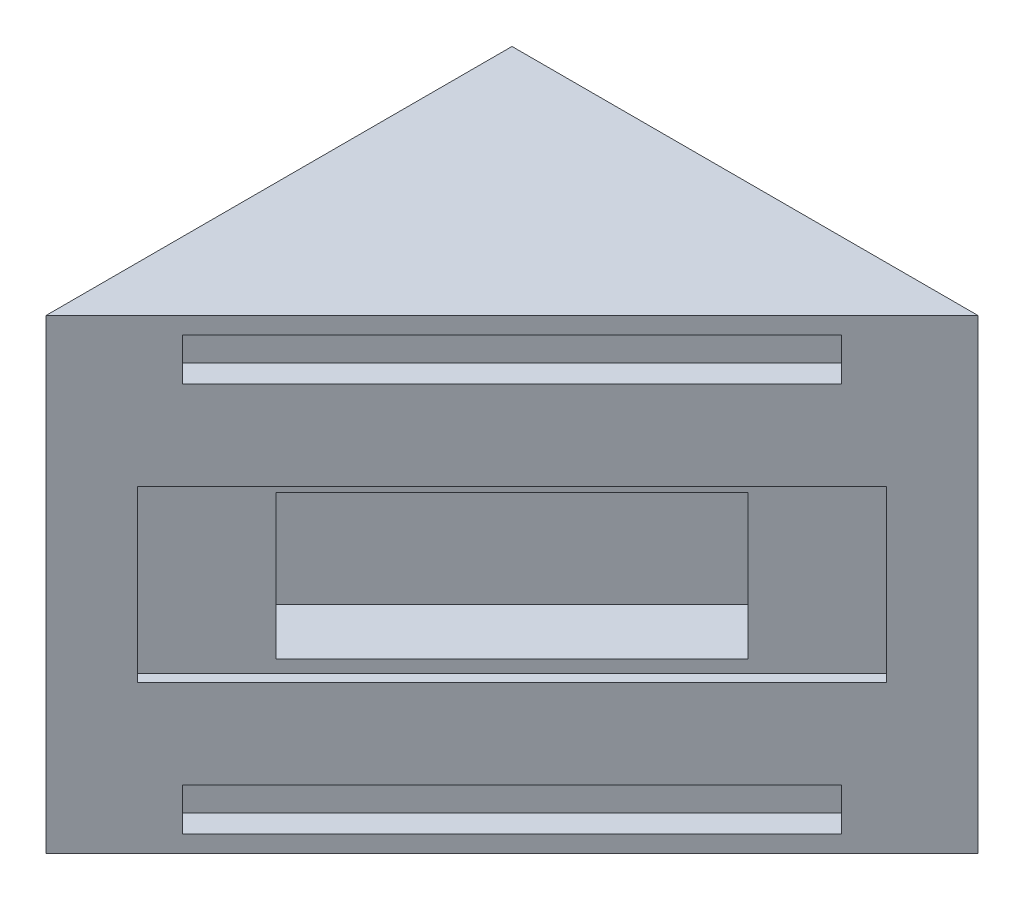
ISO-10303-21;
HEADER;
FILE_DESCRIPTION(('STEP AP214'),'2;1');
FILE_NAME('part.step','',(''),(''),'','','');
FILE_SCHEMA(('AUTOMOTIVE_DESIGN { 1 0 10303 214 1 1 1 1 }'));
ENDSEC;
DATA;
#1=APPLICATION_CONTEXT('core data for automotive mechanical design processes');
#2=APPLICATION_PROTOCOL_DEFINITION('international standard','automotive_design',2000,#1);
#3=PRODUCT_CONTEXT('',#1,'mechanical');
#4=PRODUCT('Part','Part','',(#3));
#5=PRODUCT_RELATED_PRODUCT_CATEGORY('part','',(#4));
#6=PRODUCT_DEFINITION_FORMATION('','',#4);
#7=PRODUCT_DEFINITION_CONTEXT('part definition',#1,'design');
#8=PRODUCT_DEFINITION('design','',#6,#7);
#9=PRODUCT_DEFINITION_SHAPE('','',#8);
#10=(LENGTH_UNIT() NAMED_UNIT(*) SI_UNIT(.MILLI.,.METRE.));
#11=(NAMED_UNIT(*) PLANE_ANGLE_UNIT() SI_UNIT($,.RADIAN.));
#12=(NAMED_UNIT(*) SI_UNIT($,.STERADIAN.) SOLID_ANGLE_UNIT());
#13=UNCERTAINTY_MEASURE_WITH_UNIT(LENGTH_MEASURE(1.E-05),#10,'distance_accuracy_value','');
#14=(GEOMETRIC_REPRESENTATION_CONTEXT(3) GLOBAL_UNCERTAINTY_ASSIGNED_CONTEXT((#13)) GLOBAL_UNIT_ASSIGNED_CONTEXT((#10,
#11,#12)) REPRESENTATION_CONTEXT('',''));
#15=CARTESIAN_POINT('',(0.,0.,0.));
#16=DIRECTION('',(0.,0.,1.));
#17=DIRECTION('',(1.,0.,0.));
#18=AXIS2_PLACEMENT_3D('',#15,#16,#17);
#19=CARTESIAN_POINT('',(0.,69.85,-69.85));
#20=DIRECTION('',(0.,0.,1.));
#21=DIRECTION('',(1.,0.,0.));
#22=AXIS2_PLACEMENT_3D('',#19,#20,#21);
#23=PLANE('',#22);
#24=DIRECTION('',(-1.,0.,0.));
#25=VECTOR('',#24,1.);
#26=CARTESIAN_POINT('',(0.,0.,-69.85));
#27=LINE('',#26,#25);
#28=CARTESIAN_POINT('',(69.85,0.,-69.85));
#29=VERTEX_POINT('',#28);
#30=CARTESIAN_POINT('',(0.,0.,-69.85));
#31=VERTEX_POINT('',#30);
#32=EDGE_CURVE('E67',#29,#31,#27,.T.);
#33=ORIENTED_EDGE('',*,*,#32,.T.);
#34=DIRECTION('',(0.,-1.,0.));
#35=VECTOR('',#34,1.);
#36=CARTESIAN_POINT('',(0.,69.85,-69.85));
#37=LINE('',#36,#35);
#38=CARTESIAN_POINT('',(0.,69.85,-69.85));
#39=VERTEX_POINT('',#38);
#40=EDGE_CURVE('E92',#39,#31,#37,.T.);
#41=ORIENTED_EDGE('',*,*,#40,.F.);
#42=DIRECTION('',(-1.,0.,0.));
#43=VECTOR('',#42,1.);
#44=CARTESIAN_POINT('',(0.,69.85,-69.85));
#45=LINE('',#44,#43);
#46=CARTESIAN_POINT('',(69.85,69.85,-69.85));
#47=VERTEX_POINT('',#46);
#48=EDGE_CURVE('E63',#47,#39,#45,.T.);
#49=ORIENTED_EDGE('',*,*,#48,.F.);
#50=DIRECTION('',(0.,-1.,0.));
#51=VECTOR('',#50,1.);
#52=CARTESIAN_POINT('',(69.8499999999999,69.85,-69.85));
#53=LINE('',#52,#51);
#54=EDGE_CURVE('E12',#47,#29,#53,.T.);
#55=ORIENTED_EDGE('',*,*,#54,.T.);
#56=EDGE_LOOP('',(#33,#41,#49,#55));
#57=FACE_BOUND('',#56,.T.);
#58=ADVANCED_FACE('F57',(#57),#23,.F.);
#59=CARTESIAN_POINT('',(0.,69.85,0.));
#60=DIRECTION('',(1.,0.,0.));
#61=DIRECTION('',(0.,0.,-1.));
#62=AXIS2_PLACEMENT_3D('',#59,#60,#61);
#63=PLANE('',#62);
#64=DIRECTION('',(0.,0.,1.));
#65=VECTOR('',#64,1.);
#66=CARTESIAN_POINT('',(0.,0.,0.));
#67=LINE('',#66,#65);
#68=CARTESIAN_POINT('',(0.,0.,0.));
#69=VERTEX_POINT('',#68);
#70=EDGE_CURVE('E87',#31,#69,#67,.T.);
#71=ORIENTED_EDGE('',*,*,#70,.T.);
#72=DIRECTION('',(0.,-1.,0.));
#73=VECTOR('',#72,1.);
#74=CARTESIAN_POINT('',(0.,69.85,0.));
#75=LINE('',#74,#73);
#76=CARTESIAN_POINT('',(0.,69.85,0.));
#77=VERTEX_POINT('',#76);
#78=EDGE_CURVE('E90',#77,#69,#75,.T.);
#79=ORIENTED_EDGE('',*,*,#78,.F.);
#80=DIRECTION('',(0.,0.,1.));
#81=VECTOR('',#80,1.);
#82=CARTESIAN_POINT('',(0.,69.85,0.));
#83=LINE('',#82,#81);
#84=EDGE_CURVE('E96',#39,#77,#83,.T.);
#85=ORIENTED_EDGE('',*,*,#84,.F.);
#86=ORIENTED_EDGE('',*,*,#40,.T.);
#87=EDGE_LOOP('',(#71,#79,#85,#86));
#88=FACE_BOUND('',#87,.T.);
#89=ADVANCED_FACE('F89',(#88),#63,.F.);
#90=OPEN_SHELL('',(#58,#89));
#91=SHELL_BASED_SURFACE_MODEL('B2',(#90));
#92=CARTESIAN_POINT('',(0.,69.85,0.));
#93=DIRECTION('',(0.,-1.,0.));
#94=DIRECTION('',(0.,0.,-1.));
#95=AXIS2_PLACEMENT_3D('',#92,#93,#94);
#96=PLANE('',#95);
#97=DIRECTION('',(-0.707106781186548,0.,0.707106781186547));
#98=VECTOR('',#97,1.);
#99=CARTESIAN_POINT('',(34.925,69.85,-34.9249999999999));
#100=LINE('',#99,#98);
#101=CARTESIAN_POINT('',(69.85,69.85,-69.85));
#102=VERTEX_POINT('',#101);
#103=CARTESIAN_POINT('',(0.,69.85,0.));
#104=VERTEX_POINT('',#103);
#105=EDGE_CURVE('E397',#102,#104,#100,.T.);
#106=ORIENTED_EDGE('',*,*,#105,.F.);
#107=DIRECTION('',(-1.,0.,0.));
#108=VECTOR('',#107,1.);
#109=CARTESIAN_POINT('',(0.,69.85,-69.85));
#110=LINE('',#109,#108);
#111=CARTESIAN_POINT('',(0.,69.85,-69.85));
#112=VERTEX_POINT('',#111);
#113=EDGE_CURVE('E459',#102,#112,#110,.T.);
#114=ORIENTED_EDGE('',*,*,#113,.T.);
#115=DIRECTION('',(0.,0.,1.));
#116=VECTOR('',#115,1.);
#117=CARTESIAN_POINT('',(0.,69.85,0.));
#118=LINE('',#117,#116);
#119=EDGE_CURVE('E455',#112,#104,#118,.T.);
#120=ORIENTED_EDGE('',*,*,#119,.T.);
#121=EDGE_LOOP('',(#106,#114,#120));
#122=FACE_BOUND('',#121,.T.);
#123=ADVANCED_FACE('F137',(#122),#96,.F.);
#124=CARTESIAN_POINT('',(0.,0.,0.));
#125=DIRECTION('',(0.,-1.,0.));
#126=DIRECTION('',(0.,0.,-1.));
#127=AXIS2_PLACEMENT_3D('',#124,#125,#126);
#128=PLANE('',#127);
#129=DIRECTION('',(-1.,0.,0.));
#130=VECTOR('',#129,1.);
#131=CARTESIAN_POINT('',(0.,0.,-69.85));
#132=LINE('',#131,#130);
#133=CARTESIAN_POINT('',(69.85,0.,-69.85));
#134=VERTEX_POINT('',#133);
#135=CARTESIAN_POINT('',(0.,0.,-69.85));
#136=VERTEX_POINT('',#135);
#137=EDGE_CURVE('E460',#134,#136,#132,.T.);
#138=ORIENTED_EDGE('',*,*,#137,.F.);
#139=DIRECTION('',(0.707106781186547,0.,-0.707106781186547));
#140=VECTOR('',#139,1.);
#141=CARTESIAN_POINT('',(69.85,0.,-69.85));
#142=LINE('',#141,#140);
#143=CARTESIAN_POINT('',(0.,0.,0.));
#144=VERTEX_POINT('',#143);
#145=EDGE_CURVE('E451',#144,#134,#142,.T.);
#146=ORIENTED_EDGE('',*,*,#145,.F.);
#147=DIRECTION('',(0.,0.,1.));
#148=VECTOR('',#147,1.);
#149=CARTESIAN_POINT('',(0.,0.,0.));
#150=LINE('',#149,#148);
#151=EDGE_CURVE('E454',#136,#144,#150,.T.);
#152=ORIENTED_EDGE('',*,*,#151,.F.);
#153=EDGE_LOOP('',(#138,#146,#152));
#154=FACE_BOUND('',#153,.T.);
#155=ADVANCED_FACE('F483',(#154),#128,.T.);
#156=CARTESIAN_POINT('',(0.,69.85,0.));
#157=DIRECTION('',(1.,0.,0.));
#158=DIRECTION('',(0.,0.,-1.));
#159=AXIS2_PLACEMENT_3D('',#156,#157,#158);
#160=PLANE('',#159);
#161=ORIENTED_EDGE('',*,*,#151,.T.);
#162=DIRECTION('',(0.,-1.,0.));
#163=VECTOR('',#162,1.);
#164=CARTESIAN_POINT('',(0.,69.85,0.));
#165=LINE('',#164,#163);
#166=EDGE_CURVE('E55',#104,#144,#165,.T.);
#167=ORIENTED_EDGE('',*,*,#166,.F.);
#168=ORIENTED_EDGE('',*,*,#119,.F.);
#169=DIRECTION('',(0.,-1.,0.));
#170=VECTOR('',#169,1.);
#171=CARTESIAN_POINT('',(0.,69.85,-69.85));
#172=LINE('',#171,#170);
#173=EDGE_CURVE('E463',#112,#136,#172,.T.);
#174=ORIENTED_EDGE('',*,*,#173,.T.);
#175=EDGE_LOOP('',(#161,#167,#168,#174));
#176=FACE_BOUND('',#175,.T.);
#177=ADVANCED_FACE('F139',(#176),#160,.F.);
#178=CARTESIAN_POINT('',(0.,69.85,-69.85));
#179=DIRECTION('',(0.,0.,1.));
#180=DIRECTION('',(1.,0.,0.));
#181=AXIS2_PLACEMENT_3D('',#178,#179,#180);
#182=PLANE('',#181);
#183=ORIENTED_EDGE('',*,*,#137,.T.);
#184=ORIENTED_EDGE('',*,*,#173,.F.);
#185=ORIENTED_EDGE('',*,*,#113,.F.);
#186=DIRECTION('',(0.,-1.,0.));
#187=VECTOR('',#186,1.);
#188=CARTESIAN_POINT('',(69.8499999999999,69.85,-69.85));
#189=LINE('',#188,#187);
#190=EDGE_CURVE('E146',#102,#134,#189,.T.);
#191=ORIENTED_EDGE('',*,*,#190,.T.);
#192=EDGE_LOOP('',(#183,#184,#185,#191));
#193=FACE_BOUND('',#192,.T.);
#194=ADVANCED_FACE('F476',(#193),#182,.F.);
#195=CARTESIAN_POINT('',(0.,0.,0.));
#196=DIRECTION('',(0.707106781186548,0.,0.707106781186548));
#197=DIRECTION('',(0.707106781186548,0.,-0.707106781186548));
#198=AXIS2_PLACEMENT_3D('',#195,#196,#197);
#199=PLANE('',#198);
#200=DIRECTION('',(0.,-1.,0.));
#201=VECTOR('',#200,1.);
#202=CARTESIAN_POINT('',(6.86169962165886,47.625,-6.86169962165887));
#203=LINE('',#202,#201);
#204=CARTESIAN_POINT('',(6.86169962165886,47.625,-6.86169962165887));
#205=VERTEX_POINT('',#204);
#206=CARTESIAN_POINT('',(6.86169962165887,22.225,-6.86169962165887));
#207=VERTEX_POINT('',#206);
#208=EDGE_CURVE('E161',#205,#207,#203,.T.);
#209=ORIENTED_EDGE('',*,*,#208,.F.);
#210=DIRECTION('',(-0.707106781186547,0.,0.707106781186547));
#211=VECTOR('',#210,1.);
#212=CARTESIAN_POINT('',(62.9883003783411,47.625,-62.9883003783411));
#213=LINE('',#212,#211);
#214=CARTESIAN_POINT('',(62.9883003783411,47.625,-62.9883003783411));
#215=VERTEX_POINT('',#214);
#216=EDGE_CURVE('E323',#215,#205,#213,.T.);
#217=ORIENTED_EDGE('',*,*,#216,.F.);
#218=DIRECTION('',(0.,1.,0.));
#219=VECTOR('',#218,1.);
#220=CARTESIAN_POINT('',(62.9883003783411,22.225,-62.9883003783411));
#221=LINE('',#220,#219);
#222=CARTESIAN_POINT('',(62.9883003783411,22.225,-62.9883003783411));
#223=VERTEX_POINT('',#222);
#224=EDGE_CURVE('E342',#223,#215,#221,.T.);
#225=ORIENTED_EDGE('',*,*,#224,.F.);
#226=DIRECTION('',(0.707106781186547,0.,-0.707106781186548));
#227=VECTOR('',#226,1.);
#228=CARTESIAN_POINT('',(6.86169962165886,22.225,-6.86169962165887));
#229=LINE('',#228,#227);
#230=EDGE_CURVE('E338',#207,#223,#229,.T.);
#231=ORIENTED_EDGE('',*,*,#230,.F.);
#232=EDGE_LOOP('',(#209,#217,#225,#231));
#233=FACE_BOUND('',#232,.T.);
#234=DIRECTION('',(0.,-1.,0.));
#235=VECTOR('',#234,1.);
#236=CARTESIAN_POINT('',(10.2292956670598,67.31,-10.2292956670598));
#237=LINE('',#236,#235);
#238=CARTESIAN_POINT('',(10.2292956670598,67.31,-10.2292956670598));
#239=VERTEX_POINT('',#238);
#240=CARTESIAN_POINT('',(10.2292956670598,60.96,-10.2292956670598));
#241=VERTEX_POINT('',#240);
#242=EDGE_CURVE('E379',#239,#241,#237,.T.);
#243=ORIENTED_EDGE('',*,*,#242,.F.);
#244=DIRECTION('',(-0.707106781186547,0.,0.707106781186548));
#245=VECTOR('',#244,1.);
#246=CARTESIAN_POINT('',(10.2292956670598,67.31,-10.2292956670598));
#247=LINE('',#246,#245);
#248=CARTESIAN_POINT('',(59.6207043329401,67.31,-59.6207043329402));
#249=VERTEX_POINT('',#248);
#250=EDGE_CURVE('E366',#249,#239,#247,.T.);
#251=ORIENTED_EDGE('',*,*,#250,.F.);
#252=DIRECTION('',(0.,1.,0.));
#253=VECTOR('',#252,1.);
#254=CARTESIAN_POINT('',(59.6207043329401,67.31,-59.6207043329402));
#255=LINE('',#254,#253);
#256=CARTESIAN_POINT('',(59.6207043329401,60.96,-59.6207043329401));
#257=VERTEX_POINT('',#256);
#258=EDGE_CURVE('E387',#257,#249,#255,.T.);
#259=ORIENTED_EDGE('',*,*,#258,.F.);
#260=DIRECTION('',(0.707106781186547,0.,-0.707106781186548));
#261=VECTOR('',#260,1.);
#262=CARTESIAN_POINT('',(10.2292956670598,60.96,-10.2292956670598));
#263=LINE('',#262,#261);
#264=EDGE_CURVE('E382',#241,#257,#263,.T.);
#265=ORIENTED_EDGE('',*,*,#264,.F.);
#266=EDGE_LOOP('',(#243,#251,#259,#265));
#267=FACE_BOUND('',#266,.T.);
#268=DIRECTION('',(0.,-1.,0.));
#269=VECTOR('',#268,1.);
#270=CARTESIAN_POINT('',(10.2292956670598,8.89,-10.2292956670598));
#271=LINE('',#270,#269);
#272=CARTESIAN_POINT('',(10.2292956670598,8.89,-10.2292956670598));
#273=VERTEX_POINT('',#272);
#274=CARTESIAN_POINT('',(10.2292956670598,2.54,-10.2292956670598));
#275=VERTEX_POINT('',#274);
#276=EDGE_CURVE('E383',#273,#275,#271,.T.);
#277=ORIENTED_EDGE('',*,*,#276,.F.);
#278=DIRECTION('',(-0.707106781186547,0.,0.707106781186548));
#279=VECTOR('',#278,1.);
#280=CARTESIAN_POINT('',(10.2292956670598,8.89,-10.2292956670598));
#281=LINE('',#280,#279);
#282=CARTESIAN_POINT('',(59.6207043329401,8.89,-59.6207043329402));
#283=VERTEX_POINT('',#282);
#284=EDGE_CURVE('E420',#283,#273,#281,.T.);
#285=ORIENTED_EDGE('',*,*,#284,.F.);
#286=DIRECTION('',(0.,1.,0.));
#287=VECTOR('',#286,1.);
#288=CARTESIAN_POINT('',(59.6207043329401,8.89,-59.6207043329402));
#289=LINE('',#288,#287);
#290=CARTESIAN_POINT('',(59.6207043329401,2.54,-59.6207043329402));
#291=VERTEX_POINT('',#290);
#292=EDGE_CURVE('E424',#291,#283,#289,.T.);
#293=ORIENTED_EDGE('',*,*,#292,.F.);
#294=DIRECTION('',(0.707106781186547,0.,-0.707106781186548));
#295=VECTOR('',#294,1.);
#296=CARTESIAN_POINT('',(10.2292956670598,2.54,-10.2292956670598));
#297=LINE('',#296,#295);
#298=EDGE_CURVE('E429',#275,#291,#297,.T.);
#299=ORIENTED_EDGE('',*,*,#298,.F.);
#300=EDGE_LOOP('',(#277,#285,#293,#299));
#301=FACE_BOUND('',#300,.T.);
#302=ORIENTED_EDGE('',*,*,#105,.T.);
#303=ORIENTED_EDGE('',*,*,#166,.T.);
#304=ORIENTED_EDGE('',*,*,#145,.T.);
#305=ORIENTED_EDGE('',*,*,#190,.F.);
#306=EDGE_LOOP('',(#302,#303,#304,#305));
#307=FACE_BOUND('',#306,.T.);
#308=ADVANCED_FACE('F488',(#233,#267,#301,#307),#199,.T.);
#309=CARTESIAN_POINT('',(7.53521883073905,8.89,-12.9233725033805));
#310=DIRECTION('',(-0.707106781186547,0.,0.707106781186548));
#311=DIRECTION('',(0.707106781186548,0.,0.707106781186547));
#312=AXIS2_PLACEMENT_3D('',#309,#310,#311);
#313=PLANE('',#312);
#314=ORIENTED_EDGE('',*,*,#276,.T.);
#315=DIRECTION('',(0.707106781186548,0.,0.707106781186547));
#316=VECTOR('',#315,1.);
#317=CARTESIAN_POINT('',(7.53521883073905,2.54,-12.9233725033805));
#318=LINE('',#317,#316);
#319=CARTESIAN_POINT('',(7.53521883073905,2.54,-12.9233725033805));
#320=VERTEX_POINT('',#319);
#321=EDGE_CURVE('E407',#320,#275,#318,.T.);
#322=ORIENTED_EDGE('',*,*,#321,.F.);
#323=DIRECTION('',(0.,-1.,0.));
#324=VECTOR('',#323,1.);
#325=CARTESIAN_POINT('',(7.53521883073905,8.89,-12.9233725033805));
#326=LINE('',#325,#324);
#327=CARTESIAN_POINT('',(7.53521883073905,8.89,-12.9233725033805));
#328=VERTEX_POINT('',#327);
#329=EDGE_CURVE('E425',#328,#320,#326,.T.);
#330=ORIENTED_EDGE('',*,*,#329,.F.);
#331=DIRECTION('',(0.707106781186548,0.,0.707106781186547));
#332=VECTOR('',#331,1.);
#333=CARTESIAN_POINT('',(7.53521883073905,8.89,-12.9233725033805));
#334=LINE('',#333,#332);
#335=EDGE_CURVE('E352',#328,#273,#334,.T.);
#336=ORIENTED_EDGE('',*,*,#335,.T.);
#337=EDGE_LOOP('',(#314,#322,#330,#336));
#338=FACE_BOUND('',#337,.T.);
#339=ADVANCED_FACE('F490',(#338),#313,.F.);
#340=CARTESIAN_POINT('',(7.53521883073905,8.89,-12.9233725033805));
#341=DIRECTION('',(0.,1.,0.));
#342=DIRECTION('',(0.,0.,1.));
#343=AXIS2_PLACEMENT_3D('',#340,#341,#342);
#344=PLANE('',#343);
#345=ORIENTED_EDGE('',*,*,#284,.T.);
#346=ORIENTED_EDGE('',*,*,#335,.F.);
#347=DIRECTION('',(-0.707106781186547,0.,0.707106781186548));
#348=VECTOR('',#347,1.);
#349=CARTESIAN_POINT('',(7.53521883073905,8.89,-12.9233725033805));
#350=LINE('',#349,#348);
#351=CARTESIAN_POINT('',(56.9266274966194,8.89,-62.3147811692609));
#352=VERTEX_POINT('',#351);
#353=EDGE_CURVE('E411',#352,#328,#350,.T.);
#354=ORIENTED_EDGE('',*,*,#353,.F.);
#355=DIRECTION('',(0.707106781186548,0.,0.707106781186547));
#356=VECTOR('',#355,1.);
#357=CARTESIAN_POINT('',(56.9266274966194,8.89,-62.3147811692609));
#358=LINE('',#357,#356);
#359=EDGE_CURVE('E415',#352,#283,#358,.T.);
#360=ORIENTED_EDGE('',*,*,#359,.T.);
#361=EDGE_LOOP('',(#345,#346,#354,#360));
#362=FACE_BOUND('',#361,.T.);
#363=ADVANCED_FACE('F497',(#362),#344,.F.);
#364=CARTESIAN_POINT('',(56.9266274966194,8.89,-62.3147811692609));
#365=DIRECTION('',(0.707106781186547,0.,-0.707106781186548));
#366=DIRECTION('',(-0.707106781186548,0.,-0.707106781186547));
#367=AXIS2_PLACEMENT_3D('',#364,#365,#366);
#368=PLANE('',#367);
#369=ORIENTED_EDGE('',*,*,#292,.T.);
#370=ORIENTED_EDGE('',*,*,#359,.F.);
#371=DIRECTION('',(0.,1.,0.));
#372=VECTOR('',#371,1.);
#373=CARTESIAN_POINT('',(56.9266274966194,8.89,-62.3147811692609));
#374=LINE('',#373,#372);
#375=CARTESIAN_POINT('',(56.9266274966194,2.54,-62.3147811692609));
#376=VERTEX_POINT('',#375);
#377=EDGE_CURVE('E438',#376,#352,#374,.T.);
#378=ORIENTED_EDGE('',*,*,#377,.F.);
#379=DIRECTION('',(0.707106781186548,0.,0.707106781186547));
#380=VECTOR('',#379,1.);
#381=CARTESIAN_POINT('',(56.9266274966194,2.54,-62.3147811692609));
#382=LINE('',#381,#380);
#383=EDGE_CURVE('E412',#376,#291,#382,.T.);
#384=ORIENTED_EDGE('',*,*,#383,.T.);
#385=EDGE_LOOP('',(#369,#370,#378,#384));
#386=FACE_BOUND('',#385,.T.);
#387=ADVANCED_FACE('F536',(#386),#368,.F.);
#388=CARTESIAN_POINT('',(7.53521883073905,2.54,-12.9233725033805));
#389=DIRECTION('',(0.,-1.,0.));
#390=DIRECTION('',(0.,0.,-1.));
#391=AXIS2_PLACEMENT_3D('',#388,#389,#390);
#392=PLANE('',#391);
#393=ORIENTED_EDGE('',*,*,#298,.T.);
#394=ORIENTED_EDGE('',*,*,#383,.F.);
#395=DIRECTION('',(0.707106781186547,0.,-0.707106781186548));
#396=VECTOR('',#395,1.);
#397=CARTESIAN_POINT('',(7.53521883073905,2.54,-12.9233725033805));
#398=LINE('',#397,#396);
#399=EDGE_CURVE('E442',#320,#376,#398,.T.);
#400=ORIENTED_EDGE('',*,*,#399,.F.);
#401=ORIENTED_EDGE('',*,*,#321,.T.);
#402=EDGE_LOOP('',(#393,#394,#400,#401));
#403=FACE_BOUND('',#402,.T.);
#404=ADVANCED_FACE('F547',(#403),#392,.F.);
#405=CARTESIAN_POINT('',(-2.69407683632075,0.,-2.69407683632075));
#406=DIRECTION('',(0.707106781186548,0.,0.707106781186547));
#407=DIRECTION('',(0.707106781186547,0.,-0.707106781186548));
#408=AXIS2_PLACEMENT_3D('',#405,#406,#407);
#409=PLANE('',#408);
#410=ORIENTED_EDGE('',*,*,#329,.T.);
#411=ORIENTED_EDGE('',*,*,#399,.T.);
#412=ORIENTED_EDGE('',*,*,#377,.T.);
#413=ORIENTED_EDGE('',*,*,#353,.T.);
#414=EDGE_LOOP('',(#410,#411,#412,#413));
#415=FACE_BOUND('',#414,.T.);
#416=ADVANCED_FACE('F558',(#415),#409,.T.);
#417=CARTESIAN_POINT('',(7.53521883073905,67.31,-12.9233725033805));
#418=DIRECTION('',(-0.707106781186547,0.,0.707106781186548));
#419=DIRECTION('',(0.707106781186548,0.,0.707106781186547));
#420=AXIS2_PLACEMENT_3D('',#417,#418,#419);
#421=PLANE('',#420);
#422=ORIENTED_EDGE('',*,*,#242,.T.);
#423=DIRECTION('',(0.707106781186548,0.,0.707106781186547));
#424=VECTOR('',#423,1.);
#425=CARTESIAN_POINT('',(7.53521883073905,60.96,-12.9233725033805));
#426=LINE('',#425,#424);
#427=CARTESIAN_POINT('',(7.53521883073905,60.96,-12.9233725033805));
#428=VERTEX_POINT('',#427);
#429=EDGE_CURVE('E378',#428,#241,#426,.T.);
#430=ORIENTED_EDGE('',*,*,#429,.F.);
#431=DIRECTION('',(0.,-1.,0.));
#432=VECTOR('',#431,1.);
#433=CARTESIAN_POINT('',(7.53521883073905,67.31,-12.9233725033805));
#434=LINE('',#433,#432);
#435=CARTESIAN_POINT('',(7.53521883073905,67.31,-12.9233725033805));
#436=VERTEX_POINT('',#435);
#437=EDGE_CURVE('E361',#436,#428,#434,.T.);
#438=ORIENTED_EDGE('',*,*,#437,.F.);
#439=DIRECTION('',(0.707106781186548,0.,0.707106781186547));
#440=VECTOR('',#439,1.);
#441=CARTESIAN_POINT('',(7.53521883073905,67.31,-12.9233725033805));
#442=LINE('',#441,#440);
#443=EDGE_CURVE('E394',#436,#239,#442,.T.);
#444=ORIENTED_EDGE('',*,*,#443,.T.);
#445=EDGE_LOOP('',(#422,#430,#438,#444));
#446=FACE_BOUND('',#445,.T.);
#447=ADVANCED_FACE('F569',(#446),#421,.F.);
#448=CARTESIAN_POINT('',(7.53521883073905,67.31,-12.9233725033805));
#449=DIRECTION('',(0.,1.,0.));
#450=DIRECTION('',(0.,0.,1.));
#451=AXIS2_PLACEMENT_3D('',#448,#449,#450);
#452=PLANE('',#451);
#453=ORIENTED_EDGE('',*,*,#250,.T.);
#454=ORIENTED_EDGE('',*,*,#443,.F.);
#455=DIRECTION('',(-0.707106781186547,0.,0.707106781186548));
#456=VECTOR('',#455,1.);
#457=CARTESIAN_POINT('',(7.53521883073905,67.31,-12.9233725033805));
#458=LINE('',#457,#456);
#459=CARTESIAN_POINT('',(56.9266274966194,67.31,-62.3147811692609));
#460=VERTEX_POINT('',#459);
#461=EDGE_CURVE('E374',#460,#436,#458,.T.);
#462=ORIENTED_EDGE('',*,*,#461,.F.);
#463=DIRECTION('',(0.707106781186548,0.,0.707106781186547));
#464=VECTOR('',#463,1.);
#465=CARTESIAN_POINT('',(56.9266274966194,67.31,-62.3147811692609));
#466=LINE('',#465,#464);
#467=EDGE_CURVE('E398',#460,#249,#466,.T.);
#468=ORIENTED_EDGE('',*,*,#467,.T.);
#469=EDGE_LOOP('',(#453,#454,#462,#468));
#470=FACE_BOUND('',#469,.T.);
#471=ADVANCED_FACE('F579',(#470),#452,.F.);
#472=CARTESIAN_POINT('',(56.9266274966194,67.31,-62.3147811692609));
#473=DIRECTION('',(0.707106781186547,0.,-0.707106781186548));
#474=DIRECTION('',(-0.707106781186548,0.,-0.707106781186547));
#475=AXIS2_PLACEMENT_3D('',#472,#473,#474);
#476=PLANE('',#475);
#477=ORIENTED_EDGE('',*,*,#258,.T.);
#478=ORIENTED_EDGE('',*,*,#467,.F.);
#479=DIRECTION('',(0.,1.,0.));
#480=VECTOR('',#479,1.);
#481=CARTESIAN_POINT('',(56.9266274966194,67.31,-62.3147811692609));
#482=LINE('',#481,#480);
#483=CARTESIAN_POINT('',(56.9266274966194,60.96,-62.3147811692609));
#484=VERTEX_POINT('',#483);
#485=EDGE_CURVE('E370',#484,#460,#482,.T.);
#486=ORIENTED_EDGE('',*,*,#485,.F.);
#487=DIRECTION('',(0.707106781186548,0.,0.707106781186547));
#488=VECTOR('',#487,1.);
#489=CARTESIAN_POINT('',(56.9266274966194,60.96,-62.3147811692609));
#490=LINE('',#489,#488);
#491=EDGE_CURVE('E401',#484,#257,#490,.T.);
#492=ORIENTED_EDGE('',*,*,#491,.T.);
#493=EDGE_LOOP('',(#477,#478,#486,#492));
#494=FACE_BOUND('',#493,.T.);
#495=ADVANCED_FACE('F590',(#494),#476,.F.);
#496=CARTESIAN_POINT('',(7.53521883073905,60.96,-12.9233725033805));
#497=DIRECTION('',(0.,-1.,0.));
#498=DIRECTION('',(0.,0.,-1.));
#499=AXIS2_PLACEMENT_3D('',#496,#497,#498);
#500=PLANE('',#499);
#501=ORIENTED_EDGE('',*,*,#264,.T.);
#502=ORIENTED_EDGE('',*,*,#491,.F.);
#503=DIRECTION('',(0.707106781186547,0.,-0.707106781186548));
#504=VECTOR('',#503,1.);
#505=CARTESIAN_POINT('',(7.53521883073905,60.96,-12.9233725033805));
#506=LINE('',#505,#504);
#507=EDGE_CURVE('E365',#428,#484,#506,.T.);
#508=ORIENTED_EDGE('',*,*,#507,.F.);
#509=ORIENTED_EDGE('',*,*,#429,.T.);
#510=EDGE_LOOP('',(#501,#502,#508,#509));
#511=FACE_BOUND('',#510,.T.);
#512=ADVANCED_FACE('F601',(#511),#500,.F.);
#513=CARTESIAN_POINT('',(-2.69407683632075,0.,-2.69407683632075));
#514=DIRECTION('',(0.707106781186548,0.,0.707106781186547));
#515=DIRECTION('',(0.707106781186547,0.,-0.707106781186548));
#516=AXIS2_PLACEMENT_3D('',#513,#514,#515);
#517=PLANE('',#516);
#518=ORIENTED_EDGE('',*,*,#437,.T.);
#519=ORIENTED_EDGE('',*,*,#507,.T.);
#520=ORIENTED_EDGE('',*,*,#485,.T.);
#521=ORIENTED_EDGE('',*,*,#461,.T.);
#522=EDGE_LOOP('',(#518,#519,#520,#521));
#523=FACE_BOUND('',#522,.T.);
#524=ADVANCED_FACE('F612',(#523),#517,.T.);
#525=CARTESIAN_POINT('',(5.73032877176039,47.625,-7.99307047155734));
#526=DIRECTION('',(-0.707106781186548,0.,0.707106781186548));
#527=DIRECTION('',(0.707106781186548,0.,0.707106781186547));
#528=AXIS2_PLACEMENT_3D('',#525,#526,#527);
#529=PLANE('',#528);
#530=ORIENTED_EDGE('',*,*,#208,.T.);
#531=DIRECTION('',(0.707106781186548,0.,0.707106781186548));
#532=VECTOR('',#531,1.);
#533=CARTESIAN_POINT('',(5.73032877176039,22.225,-7.99307047155734));
#534=LINE('',#533,#532);
#535=CARTESIAN_POINT('',(5.73032877176039,22.225,-7.99307047155734));
#536=VERTEX_POINT('',#535);
#537=EDGE_CURVE('E335',#536,#207,#534,.T.);
#538=ORIENTED_EDGE('',*,*,#537,.F.);
#539=DIRECTION('',(0.,-1.,0.));
#540=VECTOR('',#539,1.);
#541=CARTESIAN_POINT('',(5.73032877176039,47.625,-7.99307047155734));
#542=LINE('',#541,#540);
#543=CARTESIAN_POINT('',(5.73032877176039,47.625,-7.99307047155734));
#544=VERTEX_POINT('',#543);
#545=EDGE_CURVE('E318',#544,#536,#542,.T.);
#546=ORIENTED_EDGE('',*,*,#545,.F.);
#547=DIRECTION('',(0.707106781186548,0.,0.707106781186548));
#548=VECTOR('',#547,1.);
#549=CARTESIAN_POINT('',(5.73032877176039,47.625,-7.99307047155734));
#550=LINE('',#549,#548);
#551=EDGE_CURVE('E349',#544,#205,#550,.T.);
#552=ORIENTED_EDGE('',*,*,#551,.T.);
#553=EDGE_LOOP('',(#530,#538,#546,#552));
#554=FACE_BOUND('',#553,.T.);
#555=ADVANCED_FACE('F622',(#554),#529,.F.);
#556=CARTESIAN_POINT('',(61.8569295284426,47.625,-64.1196712282396));
#557=DIRECTION('',(0.,1.,0.));
#558=DIRECTION('',(0.,0.,1.));
#559=AXIS2_PLACEMENT_3D('',#556,#557,#558);
#560=PLANE('',#559);
#561=ORIENTED_EDGE('',*,*,#216,.T.);
#562=ORIENTED_EDGE('',*,*,#551,.F.);
#563=DIRECTION('',(-0.707106781186547,0.,0.707106781186547));
#564=VECTOR('',#563,1.);
#565=CARTESIAN_POINT('',(61.8569295284426,47.625,-64.1196712282396));
#566=LINE('',#565,#564);
#567=CARTESIAN_POINT('',(61.8569295284426,47.625,-64.1196712282396));
#568=VERTEX_POINT('',#567);
#569=EDGE_CURVE('E331',#568,#544,#566,.T.);
#570=ORIENTED_EDGE('',*,*,#569,.F.);
#571=DIRECTION('',(0.707106781186548,0.,0.707106781186548));
#572=VECTOR('',#571,1.);
#573=CARTESIAN_POINT('',(61.8569295284426,47.625,-64.1196712282396));
#574=LINE('',#573,#572);
#575=EDGE_CURVE('E353',#568,#215,#574,.T.);
#576=ORIENTED_EDGE('',*,*,#575,.T.);
#577=EDGE_LOOP('',(#561,#562,#570,#576));
#578=FACE_BOUND('',#577,.T.);
#579=ADVANCED_FACE('F639',(#578),#560,.F.);
#580=CARTESIAN_POINT('',(61.8569295284426,22.225,-64.1196712282396));
#581=DIRECTION('',(0.707106781186547,0.,-0.707106781186548));
#582=DIRECTION('',(-0.707106781186548,0.,-0.707106781186547));
#583=AXIS2_PLACEMENT_3D('',#580,#581,#582);
#584=PLANE('',#583);
#585=ORIENTED_EDGE('',*,*,#224,.T.);
#586=ORIENTED_EDGE('',*,*,#575,.F.);
#587=DIRECTION('',(0.,1.,0.));
#588=VECTOR('',#587,1.);
#589=CARTESIAN_POINT('',(61.8569295284426,22.225,-64.1196712282396));
#590=LINE('',#589,#588);
#591=CARTESIAN_POINT('',(61.8569295284426,22.225,-64.1196712282396));
#592=VERTEX_POINT('',#591);
#593=EDGE_CURVE('E327',#592,#568,#590,.T.);
#594=ORIENTED_EDGE('',*,*,#593,.F.);
#595=DIRECTION('',(0.707106781186548,0.,0.707106781186548));
#596=VECTOR('',#595,1.);
#597=CARTESIAN_POINT('',(61.8569295284426,22.225,-64.1196712282396));
#598=LINE('',#597,#596);
#599=EDGE_CURVE('E356',#592,#223,#598,.T.);
#600=ORIENTED_EDGE('',*,*,#599,.T.);
#601=EDGE_LOOP('',(#585,#586,#594,#600));
#602=FACE_BOUND('',#601,.T.);
#603=ADVANCED_FACE('F649',(#602),#584,.F.);
#604=CARTESIAN_POINT('',(5.73032877176039,22.225,-7.99307047155734));
#605=DIRECTION('',(0.,-1.,0.));
#606=DIRECTION('',(0.,0.,-1.));
#607=AXIS2_PLACEMENT_3D('',#604,#605,#606);
#608=PLANE('',#607);
#609=ORIENTED_EDGE('',*,*,#230,.T.);
#610=ORIENTED_EDGE('',*,*,#599,.F.);
#611=DIRECTION('',(0.707106781186547,0.,-0.707106781186548));
#612=VECTOR('',#611,1.);
#613=CARTESIAN_POINT('',(5.73032877176039,22.225,-7.99307047155734));
#614=LINE('',#613,#612);
#615=EDGE_CURVE('E322',#536,#592,#614,.T.);
#616=ORIENTED_EDGE('',*,*,#615,.F.);
#617=ORIENTED_EDGE('',*,*,#537,.T.);
#618=EDGE_LOOP('',(#609,#610,#616,#617));
#619=FACE_BOUND('',#618,.T.);
#620=ADVANCED_FACE('F660',(#619),#608,.F.);
#621=CARTESIAN_POINT('',(-1.13137084989848,0.,-1.13137084989848));
#622=DIRECTION('',(0.707106781186548,0.,0.707106781186547));
#623=DIRECTION('',(0.707106781186547,0.,-0.707106781186548));
#624=AXIS2_PLACEMENT_3D('',#621,#622,#623);
#625=PLANE('',#624);
#626=DIRECTION('',(0.,1.,0.));
#627=VECTOR('',#626,1.);
#628=CARTESIAN_POINT('',(51.4712986797652,45.72,-53.7340403795621));
#629=LINE('',#628,#627);
#630=CARTESIAN_POINT('',(51.4712986797652,24.13,-53.7340403795621));
#631=VERTEX_POINT('',#630);
#632=CARTESIAN_POINT('',(51.4712986797652,45.72,-53.7340403795621));
#633=VERTEX_POINT('',#632);
#634=EDGE_CURVE('E153',#631,#633,#629,.T.);
#635=ORIENTED_EDGE('',*,*,#634,.F.);
#636=DIRECTION('',(0.707106781186547,0.,-0.707106781186547));
#637=VECTOR('',#636,1.);
#638=CARTESIAN_POINT('',(16.1159596204378,24.13,-18.3787013202348));
#639=LINE('',#638,#637);
#640=CARTESIAN_POINT('',(16.1159596204378,24.13,-18.3787013202348));
#641=VERTEX_POINT('',#640);
#642=EDGE_CURVE('E291',#641,#631,#639,.T.);
#643=ORIENTED_EDGE('',*,*,#642,.F.);
#644=DIRECTION('',(0.,-1.,0.));
#645=VECTOR('',#644,1.);
#646=CARTESIAN_POINT('',(16.1159596204378,45.72,-18.3787013202347));
#647=LINE('',#646,#645);
#648=CARTESIAN_POINT('',(16.1159596204378,45.72,-18.3787013202347));
#649=VERTEX_POINT('',#648);
#650=EDGE_CURVE('E295',#649,#641,#647,.T.);
#651=ORIENTED_EDGE('',*,*,#650,.F.);
#652=DIRECTION('',(-0.707106781186547,0.,0.707106781186547));
#653=VECTOR('',#652,1.);
#654=CARTESIAN_POINT('',(16.1159596204378,45.72,-18.3787013202347));
#655=LINE('',#654,#653);
#656=EDGE_CURVE('E304',#633,#649,#655,.T.);
#657=ORIENTED_EDGE('',*,*,#656,.F.);
#658=EDGE_LOOP('',(#635,#643,#651,#657));
#659=FACE_BOUND('',#658,.T.);
#660=ORIENTED_EDGE('',*,*,#545,.T.);
#661=ORIENTED_EDGE('',*,*,#615,.T.);
#662=ORIENTED_EDGE('',*,*,#593,.T.);
#663=ORIENTED_EDGE('',*,*,#569,.T.);
#664=EDGE_LOOP('',(#660,#661,#662,#663));
#665=FACE_BOUND('',#664,.T.);
#666=ADVANCED_FACE('F671',(#659,#665),#625,.T.);
#667=CARTESIAN_POINT('',(44.4002308678997,45.72,-60.8051081914276));
#668=DIRECTION('',(0.707106781186548,0.,-0.707106781186548));
#669=DIRECTION('',(-0.707106781186548,0.,-0.707106781186548));
#670=AXIS2_PLACEMENT_3D('',#667,#668,#669);
#671=PLANE('',#670);
#672=ORIENTED_EDGE('',*,*,#634,.T.);
#673=DIRECTION('',(0.707106781186548,0.,0.707106781186548));
#674=VECTOR('',#673,1.);
#675=CARTESIAN_POINT('',(44.4002308678997,45.72,-60.8051081914276));
#676=LINE('',#675,#674);
#677=CARTESIAN_POINT('',(44.4002308678997,45.72,-60.8051081914276));
#678=VERTEX_POINT('',#677);
#679=EDGE_CURVE('E266',#678,#633,#676,.T.);
#680=ORIENTED_EDGE('',*,*,#679,.F.);
#681=DIRECTION('',(0.,1.,0.));
#682=VECTOR('',#681,1.);
#683=CARTESIAN_POINT('',(44.4002308678997,45.72,-60.8051081914276));
#684=LINE('',#683,#682);
#685=CARTESIAN_POINT('',(44.4002308678997,24.13,-60.8051081914276));
#686=VERTEX_POINT('',#685);
#687=EDGE_CURVE('E270',#686,#678,#684,.T.);
#688=ORIENTED_EDGE('',*,*,#687,.F.);
#689=DIRECTION('',(0.707106781186548,0.,0.707106781186548));
#690=VECTOR('',#689,1.);
#691=CARTESIAN_POINT('',(44.4002308678997,24.13,-60.8051081914276));
#692=LINE('',#691,#690);
#693=EDGE_CURVE('E310',#686,#631,#692,.T.);
#694=ORIENTED_EDGE('',*,*,#693,.T.);
#695=EDGE_LOOP('',(#672,#680,#688,#694));
#696=FACE_BOUND('',#695,.T.);
#697=ADVANCED_FACE('F268',(#696),#671,.F.);
#698=CARTESIAN_POINT('',(9.04489180857232,24.13,-25.4497691321002));
#699=DIRECTION('',(0.,-1.,0.));
#700=DIRECTION('',(0.,0.,-1.));
#701=AXIS2_PLACEMENT_3D('',#698,#699,#700);
#702=PLANE('',#701);
#703=ORIENTED_EDGE('',*,*,#642,.T.);
#704=ORIENTED_EDGE('',*,*,#693,.F.);
#705=DIRECTION('',(0.707106781186547,0.,-0.707106781186547));
#706=VECTOR('',#705,1.);
#707=CARTESIAN_POINT('',(9.04489180857232,24.13,-25.4497691321002));
#708=LINE('',#707,#706);
#709=CARTESIAN_POINT('',(9.04489180857232,24.13,-25.4497691321002));
#710=VERTEX_POINT('',#709);
#711=EDGE_CURVE('E277',#710,#686,#708,.T.);
#712=ORIENTED_EDGE('',*,*,#711,.F.);
#713=DIRECTION('',(0.707106781186548,0.,0.707106781186548));
#714=VECTOR('',#713,1.);
#715=CARTESIAN_POINT('',(9.04489180857232,24.13,-25.4497691321002));
#716=LINE('',#715,#714);
#717=EDGE_CURVE('E313',#710,#641,#716,.T.);
#718=ORIENTED_EDGE('',*,*,#717,.T.);
#719=EDGE_LOOP('',(#703,#704,#712,#718));
#720=FACE_BOUND('',#719,.T.);
#721=ADVANCED_FACE('F692',(#720),#702,.F.);
#722=CARTESIAN_POINT('',(9.04489180857231,45.72,-25.4497691321002));
#723=DIRECTION('',(-0.707106781186548,0.,0.707106781186548));
#724=DIRECTION('',(0.707106781186548,0.,0.707106781186548));
#725=AXIS2_PLACEMENT_3D('',#722,#723,#724);
#726=PLANE('',#725);
#727=ORIENTED_EDGE('',*,*,#650,.T.);
#728=ORIENTED_EDGE('',*,*,#717,.F.);
#729=DIRECTION('',(0.,-1.,0.));
#730=VECTOR('',#729,1.);
#731=CARTESIAN_POINT('',(9.04489180857231,45.72,-25.4497691321002));
#732=LINE('',#731,#730);
#733=CARTESIAN_POINT('',(9.04489180857231,45.72,-25.4497691321002));
#734=VERTEX_POINT('',#733);
#735=EDGE_CURVE('E286',#734,#710,#732,.T.);
#736=ORIENTED_EDGE('',*,*,#735,.F.);
#737=DIRECTION('',(0.707106781186548,0.,0.707106781186548));
#738=VECTOR('',#737,1.);
#739=CARTESIAN_POINT('',(9.04489180857231,45.72,-25.4497691321002));
#740=LINE('',#739,#738);
#741=EDGE_CURVE('E276',#734,#649,#740,.T.);
#742=ORIENTED_EDGE('',*,*,#741,.T.);
#743=EDGE_LOOP('',(#727,#728,#736,#742));
#744=FACE_BOUND('',#743,.T.);
#745=ADVANCED_FACE('F702',(#744),#726,.F.);
#746=CARTESIAN_POINT('',(9.04489180857231,45.72,-25.4497691321002));
#747=DIRECTION('',(0.,1.,0.));
#748=DIRECTION('',(0.,0.,1.));
#749=AXIS2_PLACEMENT_3D('',#746,#747,#748);
#750=PLANE('',#749);
#751=ORIENTED_EDGE('',*,*,#656,.T.);
#752=ORIENTED_EDGE('',*,*,#741,.F.);
#753=DIRECTION('',(-0.707106781186547,0.,0.707106781186547));
#754=VECTOR('',#753,1.);
#755=CARTESIAN_POINT('',(9.04489180857231,45.72,-25.4497691321002));
#756=LINE('',#755,#754);
#757=EDGE_CURVE('E280',#678,#734,#756,.T.);
#758=ORIENTED_EDGE('',*,*,#757,.F.);
#759=ORIENTED_EDGE('',*,*,#679,.T.);
#760=EDGE_LOOP('',(#751,#752,#758,#759));
#761=FACE_BOUND('',#760,.T.);
#762=ADVANCED_FACE('F281',(#761),#750,.F.);
#763=CARTESIAN_POINT('',(-8.20243866176396,0.,-8.20243866176396));
#764=DIRECTION('',(0.707106781186548,0.,0.707106781186548));
#765=DIRECTION('',(0.707106781186548,0.,-0.707106781186548));
#766=AXIS2_PLACEMENT_3D('',#763,#764,#765);
#767=PLANE('',#766);
#768=ORIENTED_EDGE('',*,*,#687,.T.);
#769=ORIENTED_EDGE('',*,*,#757,.T.);
#770=ORIENTED_EDGE('',*,*,#735,.T.);
#771=ORIENTED_EDGE('',*,*,#711,.T.);
#772=EDGE_LOOP('',(#768,#769,#770,#771));
#773=FACE_BOUND('',#772,.T.);
#774=ADVANCED_FACE('F288',(#773),#767,.T.);
#775=CLOSED_SHELL('',(#123,#155,#177,#194,#308,#339,#363,#387,#404,#416,#447,#471,#495,#512,
#524,#555,#579,#603,#620,#666,#697,#721,#745,#762,#774));
#776=MANIFOLD_SOLID_BREP('B6',#775);
#777=ADVANCED_BREP_SHAPE_REPRESENTATION('',(#18,#776),#14);
#778=MANIFOLD_SURFACE_SHAPE_REPRESENTATION('',(#18,#91),#14);
#779=SHAPE_REPRESENTATION('',(#18),#14);
#780=SHAPE_DEFINITION_REPRESENTATION(#9,#779);
#781=SHAPE_REPRESENTATION_RELATIONSHIP('','',#779,#777);
#782=SHAPE_REPRESENTATION_RELATIONSHIP('','',#779,#778);
ENDSEC;
END-ISO-10303-21;
